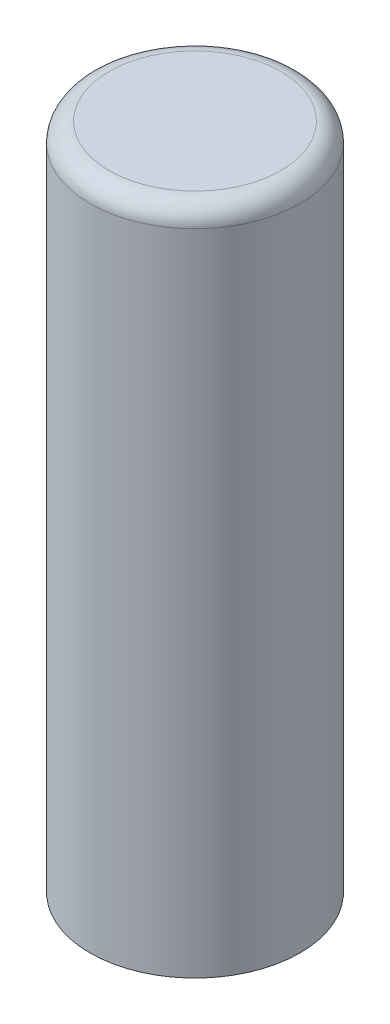
ISO-10303-21;
HEADER;
FILE_DESCRIPTION(('STEP AP214'),'2;1');
FILE_NAME('part.step','',(''),(''),'','','');
FILE_SCHEMA(('AUTOMOTIVE_DESIGN { 1 0 10303 214 1 1 1 1 }'));
ENDSEC;
DATA;
#1=APPLICATION_CONTEXT('core data for automotive mechanical design processes');
#2=APPLICATION_PROTOCOL_DEFINITION('international standard','automotive_design',2000,#1);
#3=PRODUCT_CONTEXT('',#1,'mechanical');
#4=PRODUCT('Part','Part','',(#3));
#5=PRODUCT_RELATED_PRODUCT_CATEGORY('part','',(#4));
#6=PRODUCT_DEFINITION_FORMATION('','',#4);
#7=PRODUCT_DEFINITION_CONTEXT('part definition',#1,'design');
#8=PRODUCT_DEFINITION('design','',#6,#7);
#9=PRODUCT_DEFINITION_SHAPE('','',#8);
#10=(LENGTH_UNIT() NAMED_UNIT(*) SI_UNIT(.MILLI.,.METRE.));
#11=(NAMED_UNIT(*) PLANE_ANGLE_UNIT() SI_UNIT($,.RADIAN.));
#12=(NAMED_UNIT(*) SI_UNIT($,.STERADIAN.) SOLID_ANGLE_UNIT());
#13=UNCERTAINTY_MEASURE_WITH_UNIT(LENGTH_MEASURE(1.E-05),#10,'distance_accuracy_value','');
#14=(GEOMETRIC_REPRESENTATION_CONTEXT(3) GLOBAL_UNCERTAINTY_ASSIGNED_CONTEXT((#13)) GLOBAL_UNIT_ASSIGNED_CONTEXT((#10,
#11,#12)) REPRESENTATION_CONTEXT('',''));
#15=CARTESIAN_POINT('',(0.,0.,0.));
#16=DIRECTION('',(0.,0.,1.));
#17=DIRECTION('',(1.,0.,0.));
#18=AXIS2_PLACEMENT_3D('',#15,#16,#17);
#19=CARTESIAN_POINT('',(0.,22.225,0.));
#20=DIRECTION('',(0.,-1.,0.));
#21=DIRECTION('',(0.,0.,-1.));
#22=AXIS2_PLACEMENT_3D('',#19,#20,#21);
#23=CYLINDRICAL_SURFACE('',#22,3.4925);
#24=CARTESIAN_POINT('',(0.,21.59,0.));
#25=DIRECTION('',(0.,1.,0.));
#26=DIRECTION('',(0.,0.,1.));
#27=AXIS2_PLACEMENT_3D('',#24,#25,#26);
#28=CIRCLE('',#27,3.4925);
#29=CARTESIAN_POINT('',(0.,21.59,3.4925));
#30=VERTEX_POINT('',#29);
#31=EDGE_CURVE('E10',#30,#30,#28,.F.);
#32=ORIENTED_EDGE('',*,*,#31,.T.);
#33=EDGE_LOOP('',(#32));
#34=FACE_BOUND('',#33,.T.);
#35=CARTESIAN_POINT('',(0.,0.,0.));
#36=DIRECTION('',(0.,1.,0.));
#37=DIRECTION('',(0.,0.,1.));
#38=AXIS2_PLACEMENT_3D('',#35,#36,#37);
#39=CIRCLE('',#38,3.4925);
#40=CARTESIAN_POINT('',(0.,0.,3.4925));
#41=VERTEX_POINT('',#40);
#42=EDGE_CURVE('E49',#41,#41,#39,.T.);
#43=ORIENTED_EDGE('',*,*,#42,.T.);
#44=EDGE_LOOP('',(#43));
#45=FACE_BOUND('',#44,.T.);
#46=ADVANCED_FACE('F36',(#34,#45),#23,.T.);
#47=CARTESIAN_POINT('',(0.,22.225,0.));
#48=DIRECTION('',(0.,1.,0.));
#49=DIRECTION('',(0.,0.,1.));
#50=AXIS2_PLACEMENT_3D('',#47,#48,#49);
#51=PLANE('',#50);
#52=CARTESIAN_POINT('',(0.,22.225,0.));
#53=DIRECTION('',(0.,1.,0.));
#54=DIRECTION('',(0.,0.,1.));
#55=AXIS2_PLACEMENT_3D('',#52,#53,#54);
#56=CIRCLE('',#55,2.8575);
#57=CARTESIAN_POINT('',(0.,22.225,2.8575));
#58=VERTEX_POINT('',#57);
#59=EDGE_CURVE('E44',#58,#58,#56,.T.);
#60=ORIENTED_EDGE('',*,*,#59,.T.);
#61=EDGE_LOOP('',(#60));
#62=FACE_BOUND('',#61,.T.);
#63=ADVANCED_FACE('F76',(#62),#51,.T.);
#64=CARTESIAN_POINT('',(0.,0.,0.));
#65=DIRECTION('',(0.,1.,0.));
#66=DIRECTION('',(0.,0.,1.));
#67=AXIS2_PLACEMENT_3D('',#64,#65,#66);
#68=PLANE('',#67);
#69=CARTESIAN_POINT('',(0.,0.,0.));
#70=DIRECTION('',(0.,-1.,0.));
#71=DIRECTION('',(0.,0.,-1.));
#72=AXIS2_PLACEMENT_3D('',#69,#70,#71);
#73=CIRCLE('',#72,1.778);
#74=CARTESIAN_POINT('',(0.,0.,-1.778));
#75=VERTEX_POINT('',#74);
#76=EDGE_CURVE('E57',#75,#75,#73,.T.);
#77=ORIENTED_EDGE('',*,*,#76,.F.);
#78=EDGE_LOOP('',(#77));
#79=FACE_BOUND('',#78,.T.);
#80=ORIENTED_EDGE('',*,*,#42,.F.);
#81=EDGE_LOOP('',(#80));
#82=FACE_BOUND('',#81,.T.);
#83=ADVANCED_FACE('F73',(#79,#82),#68,.F.);
#84=CARTESIAN_POINT('',(0.,21.59,0.));
#85=DIRECTION('',(0.,1.,0.));
#86=DIRECTION('',(0.,0.,1.));
#87=AXIS2_PLACEMENT_3D('',#84,#85,#86);
#88=TOROIDAL_SURFACE('',#87,2.8575,0.635);
#89=ORIENTED_EDGE('',*,*,#31,.F.);
#90=EDGE_LOOP('',(#89));
#91=FACE_BOUND('',#90,.T.);
#92=ORIENTED_EDGE('',*,*,#59,.F.);
#93=EDGE_LOOP('',(#92));
#94=FACE_BOUND('',#93,.T.);
#95=ADVANCED_FACE('F38',(#91,#94),#88,.T.);
#96=CARTESIAN_POINT('',(0.,8.255,0.));
#97=DIRECTION('',(0.,-1.,0.));
#98=DIRECTION('',(0.,0.,-1.));
#99=AXIS2_PLACEMENT_3D('',#96,#97,#98);
#100=CYLINDRICAL_SURFACE('',#99,1.778);
#101=CARTESIAN_POINT('',(0.,8.255,0.));
#102=DIRECTION('',(0.,-1.,0.));
#103=DIRECTION('',(0.,0.,-1.));
#104=AXIS2_PLACEMENT_3D('',#101,#102,#103);
#105=CIRCLE('',#104,1.778);
#106=CARTESIAN_POINT('',(0.,8.255,-1.778));
#107=VERTEX_POINT('',#106);
#108=EDGE_CURVE('E54',#107,#107,#105,.T.);
#109=ORIENTED_EDGE('',*,*,#108,.F.);
#110=EDGE_LOOP('',(#109));
#111=FACE_BOUND('',#110,.T.);
#112=ORIENTED_EDGE('',*,*,#76,.T.);
#113=EDGE_LOOP('',(#112));
#114=FACE_BOUND('',#113,.T.);
#115=ADVANCED_FACE('F67',(#111,#114),#100,.F.);
#116=CARTESIAN_POINT('',(0.,8.255,0.));
#117=DIRECTION('',(0.,-1.,0.));
#118=DIRECTION('',(0.,0.,-1.));
#119=AXIS2_PLACEMENT_3D('',#116,#117,#118);
#120=PLANE('',#119);
#121=ORIENTED_EDGE('',*,*,#108,.T.);
#122=EDGE_LOOP('',(#121));
#123=FACE_BOUND('',#122,.T.);
#124=ADVANCED_FACE('F65',(#123),#120,.T.);
#125=CLOSED_SHELL('',(#46,#63,#83,#95,#115,#124));
#126=MANIFOLD_SOLID_BREP('B2',#125);
#127=ADVANCED_BREP_SHAPE_REPRESENTATION('',(#18,#126),#14);
#128=SHAPE_DEFINITION_REPRESENTATION(#9,#127);
ENDSEC;
END-ISO-10303-21;
